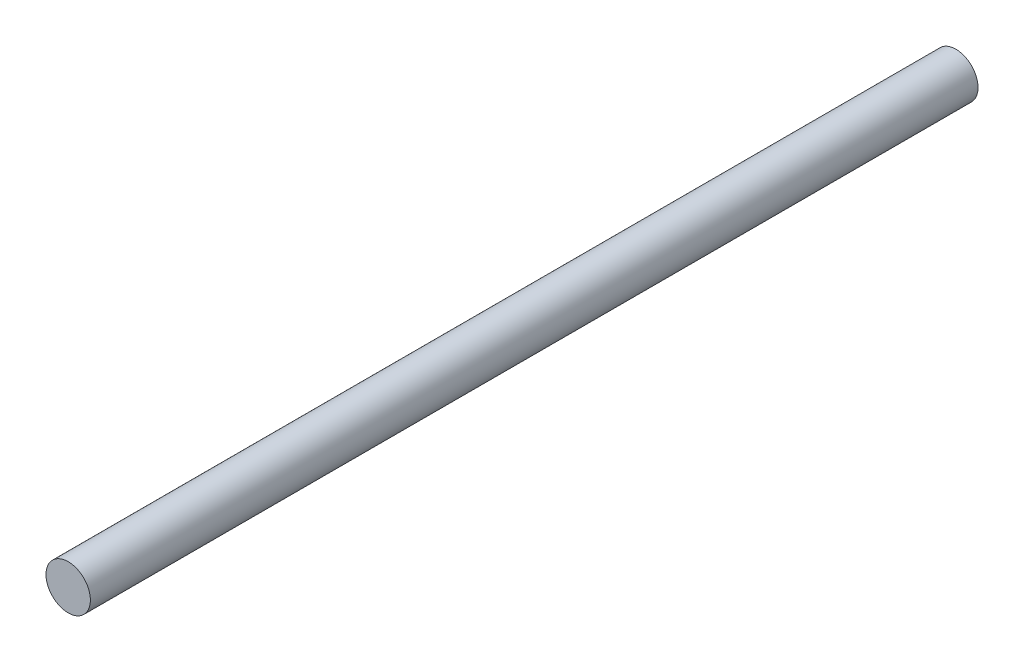
ISO-10303-21;
HEADER;
FILE_DESCRIPTION(('STEP AP214'),'2;1');
FILE_NAME('part.step','',(''),(''),'','','');
FILE_SCHEMA(('AUTOMOTIVE_DESIGN { 1 0 10303 214 1 1 1 1 }'));
ENDSEC;
DATA;
#1=APPLICATION_CONTEXT('core data for automotive mechanical design processes');
#2=APPLICATION_PROTOCOL_DEFINITION('international standard','automotive_design',2000,#1);
#3=PRODUCT_CONTEXT('',#1,'mechanical');
#4=PRODUCT('Part','Part','',(#3));
#5=PRODUCT_RELATED_PRODUCT_CATEGORY('part','',(#4));
#6=PRODUCT_DEFINITION_FORMATION('','',#4);
#7=PRODUCT_DEFINITION_CONTEXT('part definition',#1,'design');
#8=PRODUCT_DEFINITION('design','',#6,#7);
#9=PRODUCT_DEFINITION_SHAPE('','',#8);
#10=(LENGTH_UNIT() NAMED_UNIT(*) SI_UNIT(.MILLI.,.METRE.));
#11=(NAMED_UNIT(*) PLANE_ANGLE_UNIT() SI_UNIT($,.RADIAN.));
#12=(NAMED_UNIT(*) SI_UNIT($,.STERADIAN.) SOLID_ANGLE_UNIT());
#13=UNCERTAINTY_MEASURE_WITH_UNIT(LENGTH_MEASURE(1.E-05),#10,'distance_accuracy_value','');
#14=(GEOMETRIC_REPRESENTATION_CONTEXT(3) GLOBAL_UNCERTAINTY_ASSIGNED_CONTEXT((#13)) GLOBAL_UNIT_ASSIGNED_CONTEXT((#10,
#11,#12)) REPRESENTATION_CONTEXT('',''));
#15=CARTESIAN_POINT('',(0.,0.,0.));
#16=DIRECTION('',(0.,0.,1.));
#17=DIRECTION('',(1.,0.,0.));
#18=AXIS2_PLACEMENT_3D('',#15,#16,#17);
#19=CARTESIAN_POINT('',(388.894917120642,21.3157017452683,-263.556360518351));
#20=DIRECTION('',(0.,0.,-1.));
#21=DIRECTION('',(-1.,0.,0.));
#22=AXIS2_PLACEMENT_3D('',#19,#20,#21);
#23=PLANE('',#22);
#24=CARTESIAN_POINT('',(378.894917120642,52.8157017452683,-263.556360518351));
#25=DIRECTION('',(0.,0.,-1.));
#26=DIRECTION('',(-1.,0.,0.));
#27=AXIS2_PLACEMENT_3D('',#24,#25,#26);
#28=CIRCLE('',#27,1.);
#29=CARTESIAN_POINT('',(377.894917120642,52.8157017452683,-263.556360518351));
#30=VERTEX_POINT('',#29);
#31=EDGE_CURVE('E18',#30,#30,#28,.F.);
#32=ORIENTED_EDGE('',*,*,#31,.F.);
#33=EDGE_LOOP('',(#32));
#34=FACE_BOUND('',#33,.T.);
#35=ADVANCED_FACE('F15',(#34),#23,.T.);
#36=CARTESIAN_POINT('',(385.621346655693,43.3255182710061,-223.556360518351));
#37=DIRECTION('',(0.,0.,1.));
#38=DIRECTION('',(1.,0.,0.));
#39=AXIS2_PLACEMENT_3D('',#36,#37,#38);
#40=PLANE('',#39);
#41=CARTESIAN_POINT('',(378.894917120642,52.8157017452683,-223.556360518351));
#42=DIRECTION('',(0.,0.,-1.));
#43=DIRECTION('',(-1.,0.,0.));
#44=AXIS2_PLACEMENT_3D('',#41,#42,#43);
#45=CIRCLE('',#44,1.);
#46=CARTESIAN_POINT('',(377.894917120642,52.8157017452683,-223.556360518351));
#47=VERTEX_POINT('',#46);
#48=EDGE_CURVE('E10',#47,#47,#45,.T.);
#49=ORIENTED_EDGE('',*,*,#48,.F.);
#50=EDGE_LOOP('',(#49));
#51=FACE_BOUND('',#50,.T.);
#52=ADVANCED_FACE('F30',(#51),#40,.T.);
#53=CARTESIAN_POINT('',(378.894917120642,52.8157017452683,-229.556360518351));
#54=DIRECTION('',(0.,0.,-1.));
#55=DIRECTION('',(-1.,0.,0.));
#56=AXIS2_PLACEMENT_3D('',#53,#54,#55);
#57=CYLINDRICAL_SURFACE('',#56,1.);
#58=ORIENTED_EDGE('',*,*,#48,.T.);
#59=EDGE_LOOP('',(#58));
#60=FACE_BOUND('',#59,.T.);
#61=ORIENTED_EDGE('',*,*,#31,.T.);
#62=EDGE_LOOP('',(#61));
#63=FACE_BOUND('',#62,.T.);
#64=ADVANCED_FACE('F27',(#60,#63),#57,.T.);
#65=CLOSED_SHELL('',(#35,#52,#64));
#66=MANIFOLD_SOLID_BREP('B1',#65);
#67=ADVANCED_BREP_SHAPE_REPRESENTATION('',(#18,#66),#14);
#68=SHAPE_DEFINITION_REPRESENTATION(#9,#67);
ENDSEC;
END-ISO-10303-21;
